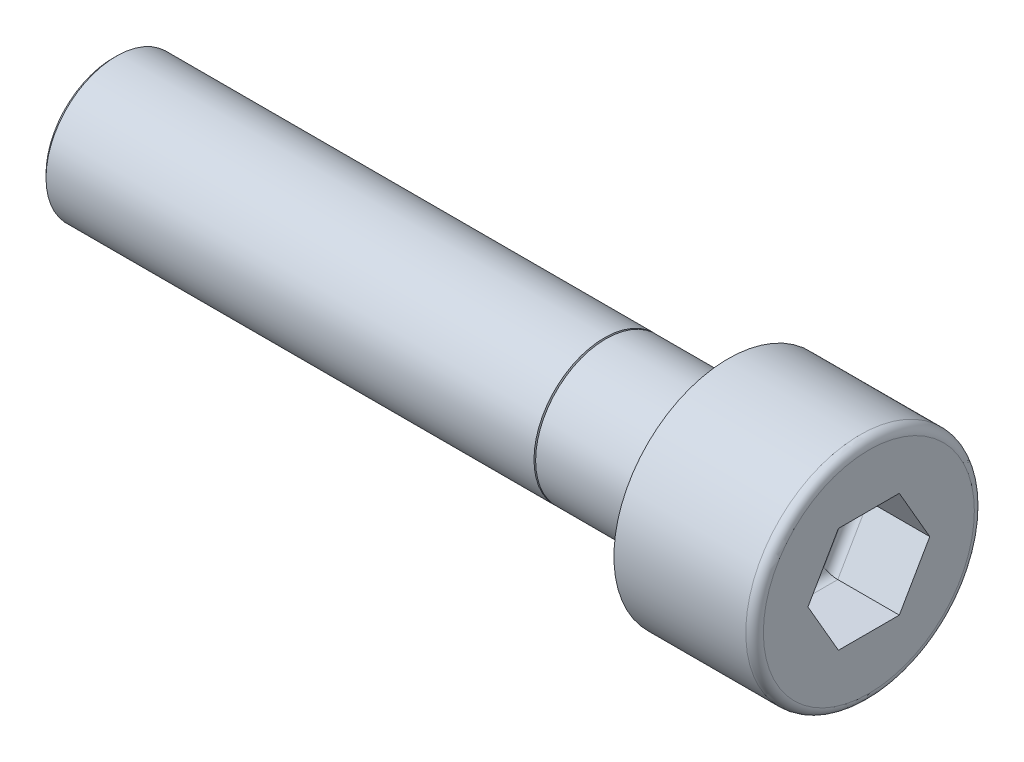
ISO-10303-21;
HEADER;
FILE_DESCRIPTION(('STEP AP214'),'2;1');
FILE_NAME('part.step','',(''),(''),'','','');
FILE_SCHEMA(('AUTOMOTIVE_DESIGN { 1 0 10303 214 1 1 1 1 }'));
ENDSEC;
DATA;
#1=APPLICATION_CONTEXT('core data for automotive mechanical design processes');
#2=APPLICATION_PROTOCOL_DEFINITION('international standard','automotive_design',2000,#1);
#3=PRODUCT_CONTEXT('',#1,'mechanical');
#4=PRODUCT('Part','Part','',(#3));
#5=PRODUCT_RELATED_PRODUCT_CATEGORY('part','',(#4));
#6=PRODUCT_DEFINITION_FORMATION('','',#4);
#7=PRODUCT_DEFINITION_CONTEXT('part definition',#1,'design');
#8=PRODUCT_DEFINITION('design','',#6,#7);
#9=PRODUCT_DEFINITION_SHAPE('','',#8);
#10=(LENGTH_UNIT() NAMED_UNIT(*) SI_UNIT(.MILLI.,.METRE.));
#11=(NAMED_UNIT(*) PLANE_ANGLE_UNIT() SI_UNIT($,.RADIAN.));
#12=(NAMED_UNIT(*) SI_UNIT($,.STERADIAN.) SOLID_ANGLE_UNIT());
#13=UNCERTAINTY_MEASURE_WITH_UNIT(LENGTH_MEASURE(1.E-05),#10,'distance_accuracy_value','');
#14=(GEOMETRIC_REPRESENTATION_CONTEXT(3) GLOBAL_UNCERTAINTY_ASSIGNED_CONTEXT((#13)) GLOBAL_UNIT_ASSIGNED_CONTEXT((#10,
#11,#12)) REPRESENTATION_CONTEXT('',''));
#15=CARTESIAN_POINT('',(0.,0.,0.));
#16=DIRECTION('',(0.,0.,1.));
#17=DIRECTION('',(1.,0.,0.));
#18=AXIS2_PLACEMENT_3D('',#15,#16,#17);
#19=CARTESIAN_POINT('',(-35.,0.,0.));
#20=DIRECTION('',(1.,0.,0.));
#21=DIRECTION('',(0.,0.,-1.));
#22=AXIS2_PLACEMENT_3D('',#19,#20,#21);
#23=CYLINDRICAL_SURFACE('',#22,4.);
#24=CARTESIAN_POINT('',(0.,0.,0.));
#25=DIRECTION('',(1.,0.,0.));
#26=DIRECTION('',(0.,0.,-1.));
#27=AXIS2_PLACEMENT_3D('',#24,#25,#26);
#28=CIRCLE('',#27,4.);
#29=CARTESIAN_POINT('',(0.,0.,-4.));
#30=VERTEX_POINT('',#29);
#31=EDGE_CURVE('E180',#30,#30,#28,.F.);
#32=ORIENTED_EDGE('',*,*,#31,.T.);
#33=EDGE_LOOP('',(#32));
#34=FACE_BOUND('',#33,.T.);
#35=CARTESIAN_POINT('',(-6.9533692341845,0.,0.));
#36=DIRECTION('',(-1.,0.,0.));
#37=DIRECTION('',(0.,0.,1.));
#38=AXIS2_PLACEMENT_3D('',#35,#36,#37);
#39=CIRCLE('',#38,4.);
#40=CARTESIAN_POINT('',(-6.9533692341845,0.,4.));
#41=VERTEX_POINT('',#40);
#42=EDGE_CURVE('E309',#41,#41,#39,.T.);
#43=ORIENTED_EDGE('',*,*,#42,.F.);
#44=EDGE_LOOP('',(#43));
#45=FACE_BOUND('',#44,.T.);
#46=ADVANCED_FACE('F36',(#34,#45),#23,.T.);
#47=CARTESIAN_POINT('',(8.,0.,0.));
#48=DIRECTION('',(-1.,0.,0.));
#49=DIRECTION('',(0.,0.,1.));
#50=AXIS2_PLACEMENT_3D('',#47,#48,#49);
#51=CYLINDRICAL_SURFACE('',#50,6.5);
#52=CARTESIAN_POINT('',(7.5,0.,0.));
#53=DIRECTION('',(1.,0.,0.));
#54=DIRECTION('',(0.,0.,-1.));
#55=AXIS2_PLACEMENT_3D('',#52,#53,#54);
#56=CIRCLE('',#55,6.5);
#57=CARTESIAN_POINT('',(7.5,0.,-6.5));
#58=VERTEX_POINT('',#57);
#59=EDGE_CURVE('E153',#58,#58,#56,.F.);
#60=ORIENTED_EDGE('',*,*,#59,.T.);
#61=EDGE_LOOP('',(#60));
#62=FACE_BOUND('',#61,.T.);
#63=CARTESIAN_POINT('',(0.,0.,0.));
#64=DIRECTION('',(1.,0.,0.));
#65=DIRECTION('',(0.,0.,-1.));
#66=AXIS2_PLACEMENT_3D('',#63,#64,#65);
#67=CIRCLE('',#66,6.5);
#68=CARTESIAN_POINT('',(0.,0.,-6.5));
#69=VERTEX_POINT('',#68);
#70=EDGE_CURVE('E141',#69,#69,#67,.T.);
#71=ORIENTED_EDGE('',*,*,#70,.T.);
#72=EDGE_LOOP('',(#71));
#73=FACE_BOUND('',#72,.T.);
#74=ADVANCED_FACE('F214',(#62,#73),#51,.T.);
#75=CARTESIAN_POINT('',(8.,0.,0.));
#76=DIRECTION('',(1.,0.,0.));
#77=DIRECTION('',(0.,0.,-1.));
#78=AXIS2_PLACEMENT_3D('',#75,#76,#77);
#79=PLANE('',#78);
#80=DIRECTION('',(0.,0.,-1.));
#81=VECTOR('',#80,1.);
#82=CARTESIAN_POINT('',(8.,-3.,1.73205080756888));
#83=LINE('',#82,#81);
#84=CARTESIAN_POINT('',(8.,-3.,1.73205080756888));
#85=VERTEX_POINT('',#84);
#86=CARTESIAN_POINT('',(8.,-3.,-1.73205080756888));
#87=VERTEX_POINT('',#86);
#88=EDGE_CURVE('E122',#85,#87,#83,.T.);
#89=ORIENTED_EDGE('',*,*,#88,.F.);
#90=DIRECTION('',(0.,-0.866025403784439,-0.5));
#91=VECTOR('',#90,1.);
#92=CARTESIAN_POINT('',(8.,0.,3.46410161513776));
#93=LINE('',#92,#91);
#94=CARTESIAN_POINT('',(8.,0.,3.46410161513776));
#95=VERTEX_POINT('',#94);
#96=EDGE_CURVE('E136',#95,#85,#93,.T.);
#97=ORIENTED_EDGE('',*,*,#96,.F.);
#98=DIRECTION('',(0.,-0.866025403784439,0.5));
#99=VECTOR('',#98,1.);
#100=CARTESIAN_POINT('',(8.,3.,1.73205080756888));
#101=LINE('',#100,#99);
#102=CARTESIAN_POINT('',(8.,3.,1.73205080756888));
#103=VERTEX_POINT('',#102);
#104=EDGE_CURVE('E130',#103,#95,#101,.T.);
#105=ORIENTED_EDGE('',*,*,#104,.F.);
#106=DIRECTION('',(0.,0.,1.));
#107=VECTOR('',#106,1.);
#108=CARTESIAN_POINT('',(8.,3.,-1.73205080756887));
#109=LINE('',#108,#107);
#110=CARTESIAN_POINT('',(8.,3.,-1.73205080756887));
#111=VERTEX_POINT('',#110);
#112=EDGE_CURVE('E128',#111,#103,#109,.T.);
#113=ORIENTED_EDGE('',*,*,#112,.F.);
#114=DIRECTION('',(0.,0.866025403784439,0.5));
#115=VECTOR('',#114,1.);
#116=CARTESIAN_POINT('',(8.,0.,-3.46410161513775));
#117=LINE('',#116,#115);
#118=CARTESIAN_POINT('',(8.,0.,-3.46410161513775));
#119=VERTEX_POINT('',#118);
#120=EDGE_CURVE('E110',#119,#111,#117,.T.);
#121=ORIENTED_EDGE('',*,*,#120,.F.);
#122=DIRECTION('',(0.,0.866025403784439,-0.5));
#123=VECTOR('',#122,1.);
#124=CARTESIAN_POINT('',(8.,-3.,-1.73205080756888));
#125=LINE('',#124,#123);
#126=EDGE_CURVE('E117',#87,#119,#125,.T.);
#127=ORIENTED_EDGE('',*,*,#126,.F.);
#128=EDGE_LOOP('',(#89,#97,#105,#113,#121,#127));
#129=FACE_BOUND('',#128,.T.);
#130=CARTESIAN_POINT('',(8.,0.,0.));
#131=DIRECTION('',(1.,0.,0.));
#132=DIRECTION('',(0.,0.,-1.));
#133=AXIS2_PLACEMENT_3D('',#130,#131,#132);
#134=CIRCLE('',#133,6.);
#135=CARTESIAN_POINT('',(8.,0.,-6.));
#136=VERTEX_POINT('',#135);
#137=EDGE_CURVE('E150',#136,#136,#134,.T.);
#138=ORIENTED_EDGE('',*,*,#137,.T.);
#139=EDGE_LOOP('',(#138));
#140=FACE_BOUND('',#139,.T.);
#141=ADVANCED_FACE('F124',(#129,#140),#79,.T.);
#142=CARTESIAN_POINT('',(0.,0.,0.));
#143=DIRECTION('',(1.,0.,0.));
#144=DIRECTION('',(0.,0.,-1.));
#145=AXIS2_PLACEMENT_3D('',#142,#143,#144);
#146=PLANE('',#145);
#147=ORIENTED_EDGE('',*,*,#31,.F.);
#148=EDGE_LOOP('',(#147));
#149=FACE_BOUND('',#148,.T.);
#150=ORIENTED_EDGE('',*,*,#70,.F.);
#151=EDGE_LOOP('',(#150));
#152=FACE_BOUND('',#151,.T.);
#153=ADVANCED_FACE('F253',(#149,#152),#146,.F.);
#154=CARTESIAN_POINT('',(7.5,0.,0.));
#155=DIRECTION('',(1.,0.,0.));
#156=DIRECTION('',(0.,0.,-1.));
#157=AXIS2_PLACEMENT_3D('',#154,#155,#156);
#158=TOROIDAL_SURFACE('',#157,6.,0.5);
#159=ORIENTED_EDGE('',*,*,#59,.F.);
#160=EDGE_LOOP('',(#159));
#161=FACE_BOUND('',#160,.T.);
#162=ORIENTED_EDGE('',*,*,#137,.F.);
#163=EDGE_LOOP('',(#162));
#164=FACE_BOUND('',#163,.T.);
#165=ADVANCED_FACE('F249',(#161,#164),#158,.T.);
#166=CARTESIAN_POINT('',(4.,-3.,1.73205080756888));
#167=DIRECTION('',(0.,-1.,0.));
#168=DIRECTION('',(0.,0.,-1.));
#169=AXIS2_PLACEMENT_3D('',#166,#167,#168);
#170=PLANE('',#169);
#171=DIRECTION('',(1.,0.,0.));
#172=VECTOR('',#171,1.);
#173=CARTESIAN_POINT('',(4.,-3.,-1.73205080756888));
#174=LINE('',#173,#172);
#175=CARTESIAN_POINT('',(4.5,-3.,-1.73205080756888));
#176=VERTEX_POINT('',#175);
#177=EDGE_CURVE('E114',#176,#87,#174,.T.);
#178=ORIENTED_EDGE('',*,*,#177,.F.);
#179=DIRECTION('',(0.,0.,-1.));
#180=VECTOR('',#179,1.);
#181=CARTESIAN_POINT('',(4.5,-3.,1.73205080756888));
#182=LINE('',#181,#180);
#183=CARTESIAN_POINT('',(4.5,-3.,1.73205080756888));
#184=VERTEX_POINT('',#183);
#185=EDGE_CURVE('E178',#176,#184,#182,.F.);
#186=ORIENTED_EDGE('',*,*,#185,.T.);
#187=DIRECTION('',(1.,0.,0.));
#188=VECTOR('',#187,1.);
#189=CARTESIAN_POINT('',(4.,-3.,1.73205080756888));
#190=LINE('',#189,#188);
#191=EDGE_CURVE('E139',#184,#85,#190,.T.);
#192=ORIENTED_EDGE('',*,*,#191,.T.);
#193=ORIENTED_EDGE('',*,*,#88,.T.);
#194=EDGE_LOOP('',(#178,#186,#192,#193));
#195=FACE_BOUND('',#194,.T.);
#196=ADVANCED_FACE('F234',(#195),#170,.F.);
#197=CARTESIAN_POINT('',(4.,0.,3.46410161513776));
#198=DIRECTION('',(0.,-0.5,0.866025403784439));
#199=DIRECTION('',(0.,-0.866025403784439,-0.5));
#200=AXIS2_PLACEMENT_3D('',#197,#198,#199);
#201=PLANE('',#200);
#202=ORIENTED_EDGE('',*,*,#191,.F.);
#203=DIRECTION('',(0.,-0.866025403784439,-0.5));
#204=VECTOR('',#203,1.);
#205=CARTESIAN_POINT('',(4.5,0.,3.46410161513776));
#206=LINE('',#205,#204);
#207=CARTESIAN_POINT('',(4.5,0.,3.46410161513776));
#208=VERTEX_POINT('',#207);
#209=EDGE_CURVE('E169',#184,#208,#206,.F.);
#210=ORIENTED_EDGE('',*,*,#209,.T.);
#211=DIRECTION('',(1.,0.,0.));
#212=VECTOR('',#211,1.);
#213=CARTESIAN_POINT('',(4.,0.,3.46410161513776));
#214=LINE('',#213,#212);
#215=EDGE_CURVE('E142',#208,#95,#214,.T.);
#216=ORIENTED_EDGE('',*,*,#215,.T.);
#217=ORIENTED_EDGE('',*,*,#96,.T.);
#218=EDGE_LOOP('',(#202,#210,#216,#217));
#219=FACE_BOUND('',#218,.T.);
#220=ADVANCED_FACE('F230',(#219),#201,.F.);
#221=CARTESIAN_POINT('',(4.,3.,1.73205080756888));
#222=DIRECTION('',(0.,0.5,0.866025403784439));
#223=DIRECTION('',(0.,-0.866025403784439,0.5));
#224=AXIS2_PLACEMENT_3D('',#221,#222,#223);
#225=PLANE('',#224);
#226=ORIENTED_EDGE('',*,*,#215,.F.);
#227=DIRECTION('',(0.,-0.866025403784439,0.5));
#228=VECTOR('',#227,1.);
#229=CARTESIAN_POINT('',(4.5,3.,1.73205080756888));
#230=LINE('',#229,#228);
#231=CARTESIAN_POINT('',(4.5,3.,1.73205080756888));
#232=VERTEX_POINT('',#231);
#233=EDGE_CURVE('E172',#208,#232,#230,.F.);
#234=ORIENTED_EDGE('',*,*,#233,.T.);
#235=DIRECTION('',(1.,0.,0.));
#236=VECTOR('',#235,1.);
#237=CARTESIAN_POINT('',(4.,3.,1.73205080756888));
#238=LINE('',#237,#236);
#239=EDGE_CURVE('E144',#232,#103,#238,.T.);
#240=ORIENTED_EDGE('',*,*,#239,.T.);
#241=ORIENTED_EDGE('',*,*,#104,.T.);
#242=EDGE_LOOP('',(#226,#234,#240,#241));
#243=FACE_BOUND('',#242,.T.);
#244=ADVANCED_FACE('F233',(#243),#225,.F.);
#245=CARTESIAN_POINT('',(4.,3.,-1.73205080756887));
#246=DIRECTION('',(0.,1.,0.));
#247=DIRECTION('',(0.,0.,1.));
#248=AXIS2_PLACEMENT_3D('',#245,#246,#247);
#249=PLANE('',#248);
#250=ORIENTED_EDGE('',*,*,#239,.F.);
#251=DIRECTION('',(0.,0.,1.));
#252=VECTOR('',#251,1.);
#253=CARTESIAN_POINT('',(4.5,3.,-1.73205080756887));
#254=LINE('',#253,#252);
#255=CARTESIAN_POINT('',(4.5,3.,-1.73205080756887));
#256=VERTEX_POINT('',#255);
#257=EDGE_CURVE('E174',#232,#256,#254,.F.);
#258=ORIENTED_EDGE('',*,*,#257,.T.);
#259=DIRECTION('',(1.,0.,0.));
#260=VECTOR('',#259,1.);
#261=CARTESIAN_POINT('',(4.,3.,-1.73205080756887));
#262=LINE('',#261,#260);
#263=EDGE_CURVE('E113',#256,#111,#262,.T.);
#264=ORIENTED_EDGE('',*,*,#263,.T.);
#265=ORIENTED_EDGE('',*,*,#112,.T.);
#266=EDGE_LOOP('',(#250,#258,#264,#265));
#267=FACE_BOUND('',#266,.T.);
#268=ADVANCED_FACE('F238',(#267),#249,.F.);
#269=CARTESIAN_POINT('',(4.,0.,-3.46410161513775));
#270=DIRECTION('',(0.,0.5,-0.866025403784439));
#271=DIRECTION('',(0.,0.866025403784439,0.5));
#272=AXIS2_PLACEMENT_3D('',#269,#270,#271);
#273=PLANE('',#272);
#274=ORIENTED_EDGE('',*,*,#263,.F.);
#275=DIRECTION('',(0.,0.866025403784439,0.5));
#276=VECTOR('',#275,1.);
#277=CARTESIAN_POINT('',(4.5,0.,-3.46410161513775));
#278=LINE('',#277,#276);
#279=CARTESIAN_POINT('',(4.5,0.,-3.46410161513775));
#280=VERTEX_POINT('',#279);
#281=EDGE_CURVE('E59',#256,#280,#278,.F.);
#282=ORIENTED_EDGE('',*,*,#281,.T.);
#283=DIRECTION('',(1.,0.,0.));
#284=VECTOR('',#283,1.);
#285=CARTESIAN_POINT('',(4.,0.,-3.46410161513775));
#286=LINE('',#285,#284);
#287=EDGE_CURVE('E106',#280,#119,#286,.T.);
#288=ORIENTED_EDGE('',*,*,#287,.T.);
#289=ORIENTED_EDGE('',*,*,#120,.T.);
#290=EDGE_LOOP('',(#274,#282,#288,#289));
#291=FACE_BOUND('',#290,.T.);
#292=ADVANCED_FACE('F108',(#291),#273,.F.);
#293=CARTESIAN_POINT('',(4.,-3.,-1.73205080756888));
#294=DIRECTION('',(0.,-0.5,-0.866025403784439));
#295=DIRECTION('',(0.,0.866025403784439,-0.5));
#296=AXIS2_PLACEMENT_3D('',#293,#294,#295);
#297=PLANE('',#296);
#298=ORIENTED_EDGE('',*,*,#287,.F.);
#299=DIRECTION('',(0.,0.866025403784439,-0.5));
#300=VECTOR('',#299,1.);
#301=CARTESIAN_POINT('',(4.5,-3.,-1.73205080756888));
#302=LINE('',#301,#300);
#303=EDGE_CURVE('E51',#280,#176,#302,.F.);
#304=ORIENTED_EDGE('',*,*,#303,.T.);
#305=ORIENTED_EDGE('',*,*,#177,.T.);
#306=ORIENTED_EDGE('',*,*,#126,.T.);
#307=EDGE_LOOP('',(#298,#304,#305,#306));
#308=FACE_BOUND('',#307,.T.);
#309=ADVANCED_FACE('F118',(#308),#297,.F.);
#310=CARTESIAN_POINT('',(4.,0.,0.));
#311=DIRECTION('',(1.,0.,0.));
#312=DIRECTION('',(0.,0.,-1.));
#313=AXIS2_PLACEMENT_3D('',#310,#311,#312);
#314=PLANE('',#313);
#315=DIRECTION('',(0.,-0.866025403784439,0.5));
#316=VECTOR('',#315,1.);
#317=CARTESIAN_POINT('',(4.,1.25,2.1650635094611));
#318=LINE('',#317,#316);
#319=CARTESIAN_POINT('',(4.,2.5,1.44337567297406));
#320=VERTEX_POINT('',#319);
#321=CARTESIAN_POINT('',(4.,0.,2.88675134594813));
#322=VERTEX_POINT('',#321);
#323=EDGE_CURVE('E164',#320,#322,#318,.T.);
#324=ORIENTED_EDGE('',*,*,#323,.T.);
#325=DIRECTION('',(0.,-0.866025403784439,-0.5));
#326=VECTOR('',#325,1.);
#327=CARTESIAN_POINT('',(4.,-1.25,2.1650635094611));
#328=LINE('',#327,#326);
#329=CARTESIAN_POINT('',(4.,-2.5,1.44337567297407));
#330=VERTEX_POINT('',#329);
#331=EDGE_CURVE('E166',#322,#330,#328,.T.);
#332=ORIENTED_EDGE('',*,*,#331,.T.);
#333=DIRECTION('',(0.,0.,-1.));
#334=VECTOR('',#333,1.);
#335=CARTESIAN_POINT('',(4.,-2.5,0.));
#336=LINE('',#335,#334);
#337=CARTESIAN_POINT('',(4.,-2.5,-1.44337567297406));
#338=VERTEX_POINT('',#337);
#339=EDGE_CURVE('E156',#330,#338,#336,.T.);
#340=ORIENTED_EDGE('',*,*,#339,.T.);
#341=DIRECTION('',(0.,0.866025403784439,-0.5));
#342=VECTOR('',#341,1.);
#343=CARTESIAN_POINT('',(4.,-1.25,-2.1650635094611));
#344=LINE('',#343,#342);
#345=CARTESIAN_POINT('',(4.,0.,-2.88675134594813));
#346=VERTEX_POINT('',#345);
#347=EDGE_CURVE('E158',#338,#346,#344,.T.);
#348=ORIENTED_EDGE('',*,*,#347,.T.);
#349=DIRECTION('',(0.,0.866025403784439,0.5));
#350=VECTOR('',#349,1.);
#351=CARTESIAN_POINT('',(4.,1.25,-2.1650635094611));
#352=LINE('',#351,#350);
#353=CARTESIAN_POINT('',(4.,2.5,-1.44337567297406));
#354=VERTEX_POINT('',#353);
#355=EDGE_CURVE('E160',#346,#354,#352,.T.);
#356=ORIENTED_EDGE('',*,*,#355,.T.);
#357=DIRECTION('',(0.,0.,1.));
#358=VECTOR('',#357,1.);
#359=CARTESIAN_POINT('',(4.,2.5,0.));
#360=LINE('',#359,#358);
#361=EDGE_CURVE('E162',#354,#320,#360,.T.);
#362=ORIENTED_EDGE('',*,*,#361,.T.);
#363=EDGE_LOOP('',(#324,#332,#340,#348,#356,#362));
#364=FACE_BOUND('',#363,.T.);
#365=ADVANCED_FACE('F225',(#364),#314,.T.);
#366=CARTESIAN_POINT('',(4.5,1.25,-2.1650635094611));
#367=DIRECTION('',(0.,0.866025403784439,0.5));
#368=DIRECTION('',(0.,-0.5,0.866025403784439));
#369=AXIS2_PLACEMENT_3D('',#366,#367,#368);
#370=CYLINDRICAL_SURFACE('',#369,0.5);
#371=CARTESIAN_POINT('',(4.5,0.,-2.88675134594813));
#372=DIRECTION('',(0.,1.,0.));
#373=DIRECTION('',(0.,0.,1.));
#374=AXIS2_PLACEMENT_3D('',#371,#372,#373);
#375=ELLIPSE('',#374,0.577350269189626,0.5);
#376=EDGE_CURVE('E192',#280,#346,#375,.T.);
#377=ORIENTED_EDGE('',*,*,#376,.F.);
#378=ORIENTED_EDGE('',*,*,#281,.F.);
#379=CARTESIAN_POINT('',(4.5,2.5,-1.44337567297406));
#380=DIRECTION('',(0.,0.5,0.866025403784439));
#381=DIRECTION('',(0.,-0.866025403784439,0.5));
#382=AXIS2_PLACEMENT_3D('',#379,#380,#381);
#383=ELLIPSE('',#382,0.577350269189626,0.5);
#384=EDGE_CURVE('E195',#354,#256,#383,.F.);
#385=ORIENTED_EDGE('',*,*,#384,.F.);
#386=ORIENTED_EDGE('',*,*,#355,.F.);
#387=EDGE_LOOP('',(#377,#378,#385,#386));
#388=FACE_BOUND('',#387,.T.);
#389=ADVANCED_FACE('F228',(#388),#370,.F.);
#390=CARTESIAN_POINT('',(4.5,2.5,0.));
#391=DIRECTION('',(0.,0.,1.));
#392=DIRECTION('',(0.,-1.,0.));
#393=AXIS2_PLACEMENT_3D('',#390,#391,#392);
#394=CYLINDRICAL_SURFACE('',#393,0.5);
#395=ORIENTED_EDGE('',*,*,#384,.T.);
#396=ORIENTED_EDGE('',*,*,#257,.F.);
#397=CARTESIAN_POINT('',(4.5,2.5,1.44337567297407));
#398=DIRECTION('',(0.,-0.5,0.866025403784439));
#399=DIRECTION('',(0.,-0.866025403784439,-0.5));
#400=AXIS2_PLACEMENT_3D('',#397,#398,#399);
#401=ELLIPSE('',#400,0.577350269189626,0.5);
#402=EDGE_CURVE('E189',#320,#232,#401,.F.);
#403=ORIENTED_EDGE('',*,*,#402,.F.);
#404=ORIENTED_EDGE('',*,*,#361,.F.);
#405=EDGE_LOOP('',(#395,#396,#403,#404));
#406=FACE_BOUND('',#405,.T.);
#407=ADVANCED_FACE('F276',(#406),#394,.F.);
#408=CARTESIAN_POINT('',(4.5,-1.25,-2.1650635094611));
#409=DIRECTION('',(0.,0.866025403784439,-0.5));
#410=DIRECTION('',(0.,0.5,0.866025403784439));
#411=AXIS2_PLACEMENT_3D('',#408,#409,#410);
#412=CYLINDRICAL_SURFACE('',#411,0.5);
#413=ORIENTED_EDGE('',*,*,#376,.T.);
#414=ORIENTED_EDGE('',*,*,#347,.F.);
#415=CARTESIAN_POINT('',(4.5,-2.5,-1.44337567297406));
#416=DIRECTION('',(0.,0.5,-0.866025403784439));
#417=DIRECTION('',(0.,0.866025403784439,0.5));
#418=AXIS2_PLACEMENT_3D('',#415,#416,#417);
#419=ELLIPSE('',#418,0.577350269189626,0.5);
#420=EDGE_CURVE('E186',#176,#338,#419,.T.);
#421=ORIENTED_EDGE('',*,*,#420,.F.);
#422=ORIENTED_EDGE('',*,*,#303,.F.);
#423=EDGE_LOOP('',(#413,#414,#421,#422));
#424=FACE_BOUND('',#423,.T.);
#425=ADVANCED_FACE('F272',(#424),#412,.F.);
#426=CARTESIAN_POINT('',(4.5,1.25,2.1650635094611));
#427=DIRECTION('',(0.,-0.866025403784439,0.5));
#428=DIRECTION('',(0.,-0.5,-0.866025403784439));
#429=AXIS2_PLACEMENT_3D('',#426,#427,#428);
#430=CYLINDRICAL_SURFACE('',#429,0.5);
#431=ORIENTED_EDGE('',*,*,#402,.T.);
#432=ORIENTED_EDGE('',*,*,#233,.F.);
#433=CARTESIAN_POINT('',(4.5,0.,2.88675134594813));
#434=DIRECTION('',(0.,-1.,0.));
#435=DIRECTION('',(0.,0.,-1.));
#436=AXIS2_PLACEMENT_3D('',#433,#434,#435);
#437=ELLIPSE('',#436,0.577350269189626,0.5);
#438=EDGE_CURVE('E183',#322,#208,#437,.F.);
#439=ORIENTED_EDGE('',*,*,#438,.F.);
#440=ORIENTED_EDGE('',*,*,#323,.F.);
#441=EDGE_LOOP('',(#431,#432,#439,#440));
#442=FACE_BOUND('',#441,.T.);
#443=ADVANCED_FACE('F268',(#442),#430,.F.);
#444=CARTESIAN_POINT('',(4.5,-2.5,0.));
#445=DIRECTION('',(0.,0.,-1.));
#446=DIRECTION('',(0.,1.,0.));
#447=AXIS2_PLACEMENT_3D('',#444,#445,#446);
#448=CYLINDRICAL_SURFACE('',#447,0.5);
#449=ORIENTED_EDGE('',*,*,#420,.T.);
#450=ORIENTED_EDGE('',*,*,#339,.F.);
#451=CARTESIAN_POINT('',(4.5,-2.5,1.44337567297407));
#452=DIRECTION('',(0.,-0.5,-0.866025403784439));
#453=DIRECTION('',(0.,-0.866025403784439,0.5));
#454=AXIS2_PLACEMENT_3D('',#451,#452,#453);
#455=ELLIPSE('',#454,0.577350269189626,0.5);
#456=EDGE_CURVE('E181',#184,#330,#455,.T.);
#457=ORIENTED_EDGE('',*,*,#456,.F.);
#458=ORIENTED_EDGE('',*,*,#185,.F.);
#459=EDGE_LOOP('',(#449,#450,#457,#458));
#460=FACE_BOUND('',#459,.T.);
#461=ADVANCED_FACE('F264',(#460),#448,.F.);
#462=CARTESIAN_POINT('',(4.5,-1.25,2.1650635094611));
#463=DIRECTION('',(0.,-0.866025403784439,-0.5));
#464=DIRECTION('',(0.,0.5,-0.866025403784439));
#465=AXIS2_PLACEMENT_3D('',#462,#463,#464);
#466=CYLINDRICAL_SURFACE('',#465,0.5);
#467=ORIENTED_EDGE('',*,*,#438,.T.);
#468=ORIENTED_EDGE('',*,*,#209,.F.);
#469=ORIENTED_EDGE('',*,*,#456,.T.);
#470=ORIENTED_EDGE('',*,*,#331,.F.);
#471=EDGE_LOOP('',(#467,#468,#469,#470));
#472=FACE_BOUND('',#471,.T.);
#473=ADVANCED_FACE('F260',(#472),#466,.F.);
#474=CARTESIAN_POINT('',(-7.04663076581551,0.,0.));
#475=DIRECTION('',(-1.,0.,0.));
#476=DIRECTION('',(0.,0.,1.));
#477=AXIS2_PLACEMENT_3D('',#474,#475,#476);
#478=CONICAL_SURFACE('',#477,4.,1.13446401379629);
#479=CARTESIAN_POINT('',(-7.,0.,0.));
#480=DIRECTION('',(-1.,0.,0.));
#481=DIRECTION('',(0.,0.,1.));
#482=AXIS2_PLACEMENT_3D('',#479,#480,#481);
#483=CIRCLE('',#482,3.9);
#484=CARTESIAN_POINT('',(-7.,0.,3.9));
#485=VERTEX_POINT('',#484);
#486=EDGE_CURVE('E306',#485,#485,#483,.T.);
#487=ORIENTED_EDGE('',*,*,#486,.T.);
#488=EDGE_LOOP('',(#487));
#489=FACE_BOUND('',#488,.T.);
#490=CARTESIAN_POINT('',(-7.04663076581551,0.,0.));
#491=DIRECTION('',(-1.,0.,0.));
#492=DIRECTION('',(0.,0.,1.));
#493=AXIS2_PLACEMENT_3D('',#490,#491,#492);
#494=CIRCLE('',#493,4.);
#495=CARTESIAN_POINT('',(-7.04663076581551,0.,4.));
#496=VERTEX_POINT('',#495);
#497=EDGE_CURVE('E184',#496,#496,#494,.T.);
#498=ORIENTED_EDGE('',*,*,#497,.F.);
#499=EDGE_LOOP('',(#498));
#500=FACE_BOUND('',#499,.T.);
#501=ADVANCED_FACE('F263',(#489,#500),#478,.T.);
#502=CARTESIAN_POINT('',(-7.,0.,0.));
#503=DIRECTION('',(1.,0.,0.));
#504=DIRECTION('',(0.,0.,-1.));
#505=AXIS2_PLACEMENT_3D('',#502,#503,#504);
#506=CONICAL_SURFACE('',#505,3.9,1.13446401379631);
#507=ORIENTED_EDGE('',*,*,#42,.T.);
#508=EDGE_LOOP('',(#507));
#509=FACE_BOUND('',#508,.T.);
#510=ORIENTED_EDGE('',*,*,#486,.F.);
#511=EDGE_LOOP('',(#510));
#512=FACE_BOUND('',#511,.T.);
#513=ADVANCED_FACE('F313',(#509,#512),#506,.T.);
#514=CARTESIAN_POINT('',(-35.,0.,0.));
#515=DIRECTION('',(-1.,0.,0.));
#516=DIRECTION('',(0.,0.,1.));
#517=AXIS2_PLACEMENT_3D('',#514,#515,#516);
#518=PLANE('',#517);
#519=CARTESIAN_POINT('',(-35.,0.,0.));
#520=DIRECTION('',(-1.,0.,0.));
#521=DIRECTION('',(0.,0.,1.));
#522=AXIS2_PLACEMENT_3D('',#519,#520,#521);
#523=CIRCLE('',#522,3.8);
#524=CARTESIAN_POINT('',(-35.,0.,3.8));
#525=VERTEX_POINT('',#524);
#526=EDGE_CURVE('E44',#525,#525,#523,.T.);
#527=ORIENTED_EDGE('',*,*,#526,.T.);
#528=EDGE_LOOP('',(#527));
#529=FACE_BOUND('',#528,.T.);
#530=ADVANCED_FACE('F202',(#529),#518,.T.);
#531=CARTESIAN_POINT('',(-34.8,0.,0.));
#532=DIRECTION('',(-1.,0.,0.));
#533=DIRECTION('',(0.,0.,1.));
#534=AXIS2_PLACEMENT_3D('',#531,#532,#533);
#535=CIRCLE('',#534,4.);
#536=CARTESIAN_POINT('',(-34.8,0.,4.));
#537=VERTEX_POINT('',#536);
#538=EDGE_CURVE('E11',#537,#537,#535,.F.);
#539=ORIENTED_EDGE('',*,*,#538,.T.);
#540=EDGE_LOOP('',(#539));
#541=FACE_BOUND('',#540,.T.);
#542=ORIENTED_EDGE('',*,*,#497,.T.);
#543=EDGE_LOOP('',(#542));
#544=FACE_BOUND('',#543,.T.);
#545=ADVANCED_FACE('F205',(#541,#544),#23,.T.);
#546=CARTESIAN_POINT('',(-35.,0.,0.));
#547=DIRECTION('',(1.,0.,0.));
#548=DIRECTION('',(0.,0.,-1.));
#549=AXIS2_PLACEMENT_3D('',#546,#547,#548);
#550=CONICAL_SURFACE('',#549,3.8,0.785398163397457);
#551=ORIENTED_EDGE('',*,*,#538,.F.);
#552=EDGE_LOOP('',(#551));
#553=FACE_BOUND('',#552,.T.);
#554=ORIENTED_EDGE('',*,*,#526,.F.);
#555=EDGE_LOOP('',(#554));
#556=FACE_BOUND('',#555,.T.);
#557=ADVANCED_FACE('F38',(#553,#556),#550,.T.);
#558=CLOSED_SHELL('',(#46,#74,#141,#153,#165,#196,#220,#244,#268,#292,#309,#365,#389,#407,#425,
#443,#461,#473,#501,#513,#530,#545,#557));
#559=MANIFOLD_SOLID_BREP('B2',#558);
#560=ADVANCED_BREP_SHAPE_REPRESENTATION('',(#18,#559),#14);
#561=SHAPE_DEFINITION_REPRESENTATION(#9,#560);
ENDSEC;
END-ISO-10303-21;
